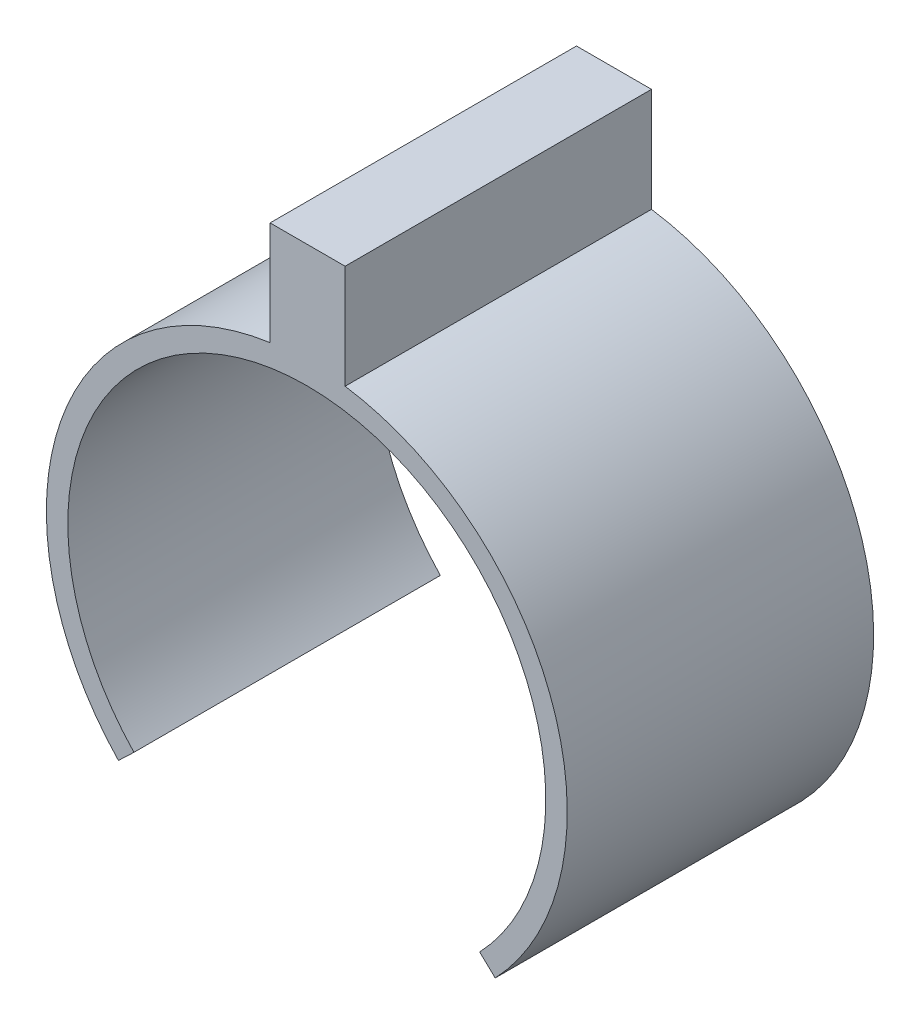
ISO-10303-21;
HEADER;
FILE_DESCRIPTION(('STEP AP214'),'2;1');
FILE_NAME('part.step','',(''),(''),'','','');
FILE_SCHEMA(('AUTOMOTIVE_DESIGN { 1 0 10303 214 1 1 1 1 }'));
ENDSEC;
DATA;
#1=APPLICATION_CONTEXT('core data for automotive mechanical design processes');
#2=APPLICATION_PROTOCOL_DEFINITION('international standard','automotive_design',2000,#1);
#3=PRODUCT_CONTEXT('',#1,'mechanical');
#4=PRODUCT('Part','Part','',(#3));
#5=PRODUCT_RELATED_PRODUCT_CATEGORY('part','',(#4));
#6=PRODUCT_DEFINITION_FORMATION('','',#4);
#7=PRODUCT_DEFINITION_CONTEXT('part definition',#1,'design');
#8=PRODUCT_DEFINITION('design','',#6,#7);
#9=PRODUCT_DEFINITION_SHAPE('','',#8);
#10=(LENGTH_UNIT() NAMED_UNIT(*) SI_UNIT(.MILLI.,.METRE.));
#11=(NAMED_UNIT(*) PLANE_ANGLE_UNIT() SI_UNIT($,.RADIAN.));
#12=(NAMED_UNIT(*) SI_UNIT($,.STERADIAN.) SOLID_ANGLE_UNIT());
#13=UNCERTAINTY_MEASURE_WITH_UNIT(LENGTH_MEASURE(1.E-05),#10,'distance_accuracy_value','');
#14=(GEOMETRIC_REPRESENTATION_CONTEXT(3) GLOBAL_UNCERTAINTY_ASSIGNED_CONTEXT((#13)) GLOBAL_UNIT_ASSIGNED_CONTEXT((#10,
#11,#12)) REPRESENTATION_CONTEXT('',''));
#15=CARTESIAN_POINT('',(0.,0.,0.));
#16=DIRECTION('',(0.,0.,1.));
#17=DIRECTION('',(1.,0.,0.));
#18=AXIS2_PLACEMENT_3D('',#15,#16,#17);
#19=CARTESIAN_POINT('',(0.,0.,5.));
#20=DIRECTION('',(0.,0.,-1.));
#21=DIRECTION('',(-1.,0.,0.));
#22=AXIS2_PLACEMENT_3D('',#19,#20,#21);
#23=CYLINDRICAL_SURFACE('',#22,4.25);
#24=DIRECTION('',(0.,0.,-1.));
#25=VECTOR('',#24,1.);
#26=CARTESIAN_POINT('',(-0.599259677951248,4.20753940425776,5.));
#27=LINE('',#26,#25);
#28=CARTESIAN_POINT('',(-0.599259677951248,4.20753940425776,0.));
#29=VERTEX_POINT('',#28);
#30=CARTESIAN_POINT('',(-0.599259677951248,4.20753940425776,5.));
#31=VERTEX_POINT('',#30);
#32=EDGE_CURVE('E11',#29,#31,#27,.F.);
#33=ORIENTED_EDGE('',*,*,#32,.F.);
#34=CARTESIAN_POINT('',(0.,0.,0.));
#35=DIRECTION('',(0.,0.,1.));
#36=DIRECTION('',(1.,0.,0.));
#37=AXIS2_PLACEMENT_3D('',#34,#35,#36);
#38=CIRCLE('',#37,4.25);
#39=CARTESIAN_POINT('',(-3.07406907156876,-2.9347230437001,0.));
#40=VERTEX_POINT('',#39);
#41=EDGE_CURVE('E151',#29,#40,#38,.T.);
#42=ORIENTED_EDGE('',*,*,#41,.T.);
#43=DIRECTION('',(0.,0.,1.));
#44=VECTOR('',#43,1.);
#45=CARTESIAN_POINT('',(-3.07406907156876,-2.9347230437001,0.));
#46=LINE('',#45,#44);
#47=CARTESIAN_POINT('',(-3.07406907156876,-2.9347230437001,5.));
#48=VERTEX_POINT('',#47);
#49=EDGE_CURVE('E139',#40,#48,#46,.T.);
#50=ORIENTED_EDGE('',*,*,#49,.T.);
#51=CARTESIAN_POINT('',(0.,0.,5.));
#52=DIRECTION('',(0.,0.,1.));
#53=DIRECTION('',(1.,0.,0.));
#54=AXIS2_PLACEMENT_3D('',#51,#52,#53);
#55=CIRCLE('',#54,4.25);
#56=EDGE_CURVE('E51',#31,#48,#55,.T.);
#57=ORIENTED_EDGE('',*,*,#56,.F.);
#58=EDGE_LOOP('',(#33,#42,#50,#57));
#59=FACE_BOUND('',#58,.T.);
#60=ADVANCED_FACE('F37',(#59),#23,.T.);
#61=DIRECTION('',(0.,0.,-1.));
#62=VECTOR('',#61,1.);
#63=CARTESIAN_POINT('',(0.625003580565938,4.20379239785693,5.));
#64=LINE('',#63,#62);
#65=CARTESIAN_POINT('',(0.625003580565938,4.20379239785693,5.));
#66=VERTEX_POINT('',#65);
#67=CARTESIAN_POINT('',(0.625003580565938,4.20379239785693,0.));
#68=VERTEX_POINT('',#67);
#69=EDGE_CURVE('E44',#66,#68,#64,.T.);
#70=ORIENTED_EDGE('',*,*,#69,.F.);
#71=CARTESIAN_POINT('',(3.07406907156876,-2.9347230437001,5.));
#72=VERTEX_POINT('',#71);
#73=EDGE_CURVE('E153',#72,#66,#55,.T.);
#74=ORIENTED_EDGE('',*,*,#73,.F.);
#75=DIRECTION('',(0.,0.,1.));
#76=VECTOR('',#75,1.);
#77=CARTESIAN_POINT('',(3.07406907156876,-2.9347230437001,0.));
#78=LINE('',#77,#76);
#79=CARTESIAN_POINT('',(3.07406907156876,-2.9347230437001,0.));
#80=VERTEX_POINT('',#79);
#81=EDGE_CURVE('E135',#80,#72,#78,.T.);
#82=ORIENTED_EDGE('',*,*,#81,.F.);
#83=EDGE_CURVE('E155',#80,#68,#38,.T.);
#84=ORIENTED_EDGE('',*,*,#83,.T.);
#85=EDGE_LOOP('',(#70,#74,#82,#84));
#86=FACE_BOUND('',#85,.T.);
#87=ADVANCED_FACE('F170',(#86),#23,.T.);
#88=CARTESIAN_POINT('',(0.,0.,5.));
#89=DIRECTION('',(0.,0.,1.));
#90=DIRECTION('',(1.,0.,0.));
#91=AXIS2_PLACEMENT_3D('',#88,#89,#90);
#92=PLANE('',#91);
#93=DIRECTION('',(0.,-1.,0.));
#94=VECTOR('',#93,1.);
#95=CARTESIAN_POINT('',(-0.599259677951248,5.9,5.));
#96=LINE('',#95,#94);
#97=CARTESIAN_POINT('',(-0.599259677951248,5.9,5.));
#98=VERTEX_POINT('',#97);
#99=EDGE_CURVE('E105',#98,#31,#96,.T.);
#100=ORIENTED_EDGE('',*,*,#99,.T.);
#101=ORIENTED_EDGE('',*,*,#56,.T.);
#102=DIRECTION('',(-0.723310369780885,-0.690523069105906,0.));
#103=VECTOR('',#102,1.);
#104=CARTESIAN_POINT('',(-3.07406907156876,-2.9347230437001,5.));
#105=LINE('',#104,#103);
#106=CARTESIAN_POINT('',(-2.82091044214545,-2.69303996951303,5.));
#107=VERTEX_POINT('',#106);
#108=EDGE_CURVE('E124',#107,#48,#105,.T.);
#109=ORIENTED_EDGE('',*,*,#108,.F.);
#110=CARTESIAN_POINT('',(0.,0.,5.));
#111=DIRECTION('',(0.,0.,1.));
#112=DIRECTION('',(1.,0.,0.));
#113=AXIS2_PLACEMENT_3D('',#110,#111,#112);
#114=CIRCLE('',#113,3.9);
#115=CARTESIAN_POINT('',(2.82091044214545,-2.69303996951303,5.));
#116=VERTEX_POINT('',#115);
#117=EDGE_CURVE('E149',#116,#107,#114,.T.);
#118=ORIENTED_EDGE('',*,*,#117,.F.);
#119=DIRECTION('',(-0.723310369780885,0.690523069105906,0.));
#120=VECTOR('',#119,1.);
#121=CARTESIAN_POINT('',(3.07406907156876,-2.9347230437001,5.));
#122=LINE('',#121,#120);
#123=EDGE_CURVE('E122',#72,#116,#122,.T.);
#124=ORIENTED_EDGE('',*,*,#123,.F.);
#125=ORIENTED_EDGE('',*,*,#73,.T.);
#126=DIRECTION('',(0.,-1.,0.));
#127=VECTOR('',#126,1.);
#128=CARTESIAN_POINT('',(0.625003580565938,5.9,5.));
#129=LINE('',#128,#127);
#130=CARTESIAN_POINT('',(0.625003580565938,5.9,5.));
#131=VERTEX_POINT('',#130);
#132=EDGE_CURVE('E107',#131,#66,#129,.T.);
#133=ORIENTED_EDGE('',*,*,#132,.F.);
#134=DIRECTION('',(1.,0.,0.));
#135=VECTOR('',#134,1.);
#136=CARTESIAN_POINT('',(-0.599259677951248,5.9,5.));
#137=LINE('',#136,#135);
#138=EDGE_CURVE('E101',#98,#131,#137,.T.);
#139=ORIENTED_EDGE('',*,*,#138,.F.);
#140=EDGE_LOOP('',(#100,#101,#109,#118,#124,#125,#133,#139));
#141=FACE_BOUND('',#140,.T.);
#142=ADVANCED_FACE('F103',(#141),#92,.T.);
#143=CARTESIAN_POINT('',(0.,0.,0.));
#144=DIRECTION('',(0.,0.,1.));
#145=DIRECTION('',(1.,0.,0.));
#146=AXIS2_PLACEMENT_3D('',#143,#144,#145);
#147=PLANE('',#146);
#148=ORIENTED_EDGE('',*,*,#41,.F.);
#149=DIRECTION('',(0.,-1.,0.));
#150=VECTOR('',#149,1.);
#151=CARTESIAN_POINT('',(-0.599259677951248,5.9,0.));
#152=LINE('',#151,#150);
#153=CARTESIAN_POINT('',(-0.599259677951248,5.9,0.));
#154=VERTEX_POINT('',#153);
#155=EDGE_CURVE('E163',#154,#29,#152,.T.);
#156=ORIENTED_EDGE('',*,*,#155,.F.);
#157=DIRECTION('',(-1.,0.,0.));
#158=VECTOR('',#157,1.);
#159=CARTESIAN_POINT('',(-0.599259677951248,5.9,0.));
#160=LINE('',#159,#158);
#161=CARTESIAN_POINT('',(0.625003580565938,5.9,0.));
#162=VERTEX_POINT('',#161);
#163=EDGE_CURVE('E116',#162,#154,#160,.T.);
#164=ORIENTED_EDGE('',*,*,#163,.F.);
#165=DIRECTION('',(0.,-1.,0.));
#166=VECTOR('',#165,1.);
#167=CARTESIAN_POINT('',(0.625003580565938,5.9,0.));
#168=LINE('',#167,#166);
#169=EDGE_CURVE('E126',#162,#68,#168,.T.);
#170=ORIENTED_EDGE('',*,*,#169,.T.);
#171=ORIENTED_EDGE('',*,*,#83,.F.);
#172=DIRECTION('',(-0.723310369780885,0.690523069105906,0.));
#173=VECTOR('',#172,1.);
#174=CARTESIAN_POINT('',(3.07406907156876,-2.9347230437001,0.));
#175=LINE('',#174,#173);
#176=CARTESIAN_POINT('',(2.82091044214546,-2.69303996951303,0.));
#177=VERTEX_POINT('',#176);
#178=EDGE_CURVE('E130',#80,#177,#175,.T.);
#179=ORIENTED_EDGE('',*,*,#178,.T.);
#180=CARTESIAN_POINT('',(0.,0.,0.));
#181=DIRECTION('',(0.,0.,1.));
#182=DIRECTION('',(1.,0.,0.));
#183=AXIS2_PLACEMENT_3D('',#180,#181,#182);
#184=CIRCLE('',#183,3.9);
#185=CARTESIAN_POINT('',(-2.82091044214545,-2.69303996951303,0.));
#186=VERTEX_POINT('',#185);
#187=EDGE_CURVE('E141',#177,#186,#184,.T.);
#188=ORIENTED_EDGE('',*,*,#187,.T.);
#189=DIRECTION('',(-0.723310369780885,-0.690523069105906,0.));
#190=VECTOR('',#189,1.);
#191=CARTESIAN_POINT('',(-3.07406907156876,-2.9347230437001,0.));
#192=LINE('',#191,#190);
#193=EDGE_CURVE('E133',#186,#40,#192,.T.);
#194=ORIENTED_EDGE('',*,*,#193,.T.);
#195=EDGE_LOOP('',(#148,#156,#164,#170,#171,#179,#188,#194));
#196=FACE_BOUND('',#195,.T.);
#197=ADVANCED_FACE('F162',(#196),#147,.F.);
#198=CARTESIAN_POINT('',(0.,0.,5.));
#199=DIRECTION('',(0.,0.,-1.));
#200=DIRECTION('',(-1.,0.,0.));
#201=AXIS2_PLACEMENT_3D('',#198,#199,#200);
#202=CYLINDRICAL_SURFACE('',#201,3.9);
#203=DIRECTION('',(0.,0.,1.));
#204=VECTOR('',#203,1.);
#205=CARTESIAN_POINT('',(-2.82091044214545,-2.69303996951303,0.));
#206=LINE('',#205,#204);
#207=EDGE_CURVE('E142',#186,#107,#206,.T.);
#208=ORIENTED_EDGE('',*,*,#207,.F.);
#209=ORIENTED_EDGE('',*,*,#187,.F.);
#210=DIRECTION('',(0.,0.,1.));
#211=VECTOR('',#210,1.);
#212=CARTESIAN_POINT('',(2.82091044214546,-2.69303996951303,0.));
#213=LINE('',#212,#211);
#214=EDGE_CURVE('E145',#177,#116,#213,.T.);
#215=ORIENTED_EDGE('',*,*,#214,.T.);
#216=ORIENTED_EDGE('',*,*,#117,.T.);
#217=EDGE_LOOP('',(#208,#209,#215,#216));
#218=FACE_BOUND('',#217,.T.);
#219=ADVANCED_FACE('F181',(#218),#202,.F.);
#220=CARTESIAN_POINT('',(3.07406907156876,-2.9347230437001,0.));
#221=DIRECTION('',(0.690523069105906,0.723310369780885,0.));
#222=DIRECTION('',(-0.723310369780885,0.690523069105906,0.));
#223=AXIS2_PLACEMENT_3D('',#220,#221,#222);
#224=PLANE('',#223);
#225=ORIENTED_EDGE('',*,*,#123,.T.);
#226=ORIENTED_EDGE('',*,*,#214,.F.);
#227=ORIENTED_EDGE('',*,*,#178,.F.);
#228=ORIENTED_EDGE('',*,*,#81,.T.);
#229=EDGE_LOOP('',(#225,#226,#227,#228));
#230=FACE_BOUND('',#229,.T.);
#231=ADVANCED_FACE('F185',(#230),#224,.F.);
#232=CARTESIAN_POINT('',(-3.07406907156876,-2.9347230437001,0.));
#233=DIRECTION('',(-0.690523069105906,0.723310369780885,0.));
#234=DIRECTION('',(-0.723310369780885,-0.690523069105906,0.));
#235=AXIS2_PLACEMENT_3D('',#232,#233,#234);
#236=PLANE('',#235);
#237=ORIENTED_EDGE('',*,*,#108,.T.);
#238=ORIENTED_EDGE('',*,*,#49,.F.);
#239=ORIENTED_EDGE('',*,*,#193,.F.);
#240=ORIENTED_EDGE('',*,*,#207,.T.);
#241=EDGE_LOOP('',(#237,#238,#239,#240));
#242=FACE_BOUND('',#241,.T.);
#243=ADVANCED_FACE('F189',(#242),#236,.F.);
#244=CARTESIAN_POINT('',(-0.599259677951248,5.9,0.));
#245=DIRECTION('',(1.,0.,0.));
#246=DIRECTION('',(0.,0.,-1.));
#247=AXIS2_PLACEMENT_3D('',#244,#245,#246);
#248=PLANE('',#247);
#249=ORIENTED_EDGE('',*,*,#155,.T.);
#250=ORIENTED_EDGE('',*,*,#32,.T.);
#251=ORIENTED_EDGE('',*,*,#99,.F.);
#252=DIRECTION('',(0.,0.,1.));
#253=VECTOR('',#252,1.);
#254=CARTESIAN_POINT('',(-0.599259677951248,5.9,0.));
#255=LINE('',#254,#253);
#256=EDGE_CURVE('E111',#154,#98,#255,.T.);
#257=ORIENTED_EDGE('',*,*,#256,.F.);
#258=EDGE_LOOP('',(#249,#250,#251,#257));
#259=FACE_BOUND('',#258,.T.);
#260=ADVANCED_FACE('F121',(#259),#248,.F.);
#261=CARTESIAN_POINT('',(0.625003580565938,5.9,0.));
#262=DIRECTION('',(-1.,0.,0.));
#263=DIRECTION('',(0.,0.,1.));
#264=AXIS2_PLACEMENT_3D('',#261,#262,#263);
#265=PLANE('',#264);
#266=ORIENTED_EDGE('',*,*,#132,.T.);
#267=ORIENTED_EDGE('',*,*,#69,.T.);
#268=ORIENTED_EDGE('',*,*,#169,.F.);
#269=DIRECTION('',(0.,0.,-1.));
#270=VECTOR('',#269,1.);
#271=CARTESIAN_POINT('',(0.625003580565938,5.9,0.));
#272=LINE('',#271,#270);
#273=EDGE_CURVE('E110',#131,#162,#272,.T.);
#274=ORIENTED_EDGE('',*,*,#273,.F.);
#275=EDGE_LOOP('',(#266,#267,#268,#274));
#276=FACE_BOUND('',#275,.T.);
#277=ADVANCED_FACE('F159',(#276),#265,.F.);
#278=CARTESIAN_POINT('',(0.,5.9,0.));
#279=DIRECTION('',(0.,1.,0.));
#280=DIRECTION('',(0.,0.,1.));
#281=AXIS2_PLACEMENT_3D('',#278,#279,#280);
#282=PLANE('',#281);
#283=ORIENTED_EDGE('',*,*,#256,.T.);
#284=ORIENTED_EDGE('',*,*,#138,.T.);
#285=ORIENTED_EDGE('',*,*,#273,.T.);
#286=ORIENTED_EDGE('',*,*,#163,.T.);
#287=EDGE_LOOP('',(#283,#284,#285,#286));
#288=FACE_BOUND('',#287,.T.);
#289=ADVANCED_FACE('F114',(#288),#282,.T.);
#290=CLOSED_SHELL('',(#60,#87,#142,#197,#219,#231,#243,#260,#277,#289));
#291=MANIFOLD_SOLID_BREP('B2',#290);
#292=ADVANCED_BREP_SHAPE_REPRESENTATION('',(#18,#291),#14);
#293=SHAPE_DEFINITION_REPRESENTATION(#9,#292);
ENDSEC;
END-ISO-10303-21;
